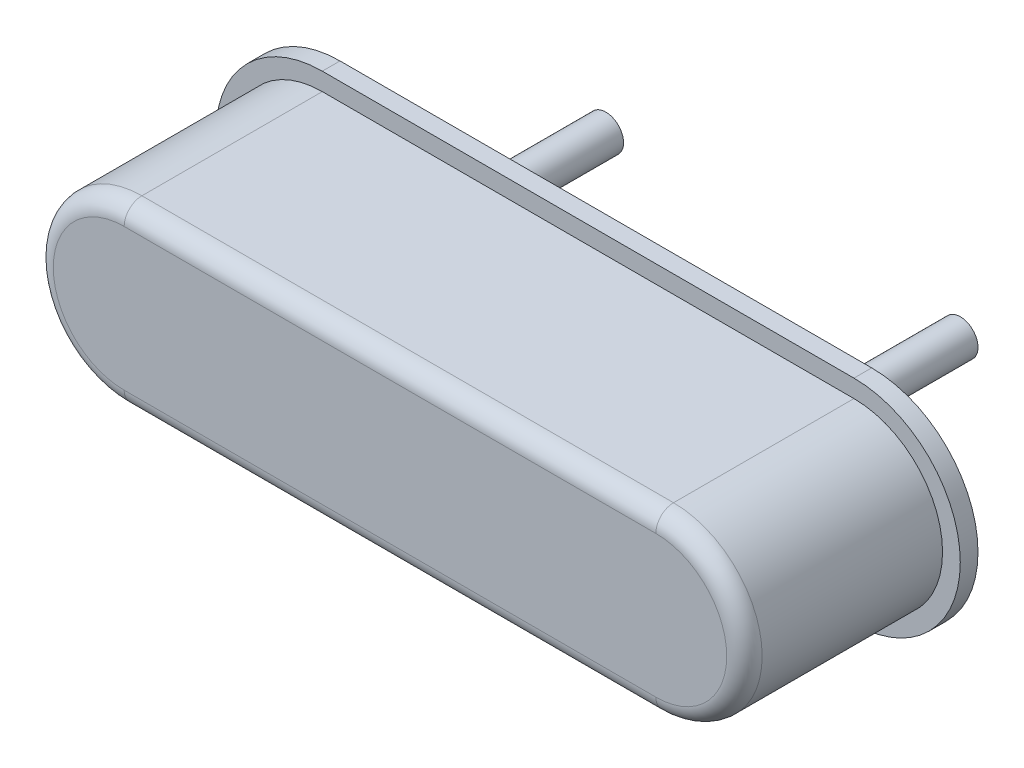
ISO-10303-21;
HEADER;
FILE_DESCRIPTION(('STEP AP214'),'2;1');
FILE_NAME('part.step','',(''),(''),'','','');
FILE_SCHEMA(('AUTOMOTIVE_DESIGN { 1 0 10303 214 1 1 1 1 }'));
ENDSEC;
DATA;
#1=APPLICATION_CONTEXT('core data for automotive mechanical design processes');
#2=APPLICATION_PROTOCOL_DEFINITION('international standard','automotive_design',2000,#1);
#3=PRODUCT_CONTEXT('',#1,'mechanical');
#4=PRODUCT('Part','Part','',(#3));
#5=PRODUCT_RELATED_PRODUCT_CATEGORY('part','',(#4));
#6=PRODUCT_DEFINITION_FORMATION('','',#4);
#7=PRODUCT_DEFINITION_CONTEXT('part definition',#1,'design');
#8=PRODUCT_DEFINITION('design','',#6,#7);
#9=PRODUCT_DEFINITION_SHAPE('','',#8);
#10=(LENGTH_UNIT() NAMED_UNIT(*) SI_UNIT(.MILLI.,.METRE.));
#11=(NAMED_UNIT(*) PLANE_ANGLE_UNIT() SI_UNIT($,.RADIAN.));
#12=(NAMED_UNIT(*) SI_UNIT($,.STERADIAN.) SOLID_ANGLE_UNIT());
#13=UNCERTAINTY_MEASURE_WITH_UNIT(LENGTH_MEASURE(1.E-05),#10,'distance_accuracy_value','');
#14=(GEOMETRIC_REPRESENTATION_CONTEXT(3) GLOBAL_UNCERTAINTY_ASSIGNED_CONTEXT((#13)) GLOBAL_UNIT_ASSIGNED_CONTEXT((#10,
#11,#12)) REPRESENTATION_CONTEXT('',''));
#15=CARTESIAN_POINT('',(0.,0.,0.));
#16=DIRECTION('',(0.,0.,1.));
#17=DIRECTION('',(1.,0.,0.));
#18=AXIS2_PLACEMENT_3D('',#15,#16,#17);
#19=CARTESIAN_POINT('',(7.62,1.27,3.09361477877701));
#20=DIRECTION('',(0.,0.,1.));
#21=DIRECTION('',(1.,0.,0.));
#22=AXIS2_PLACEMENT_3D('',#19,#20,#21);
#23=PLANE('',#22);
#24=CARTESIAN_POINT('',(-1.27,0.,3.09361477877701));
#25=DIRECTION('',(0.,0.,1.));
#26=DIRECTION('',(1.,0.,0.));
#27=AXIS2_PLACEMENT_3D('',#24,#25,#26);
#28=CIRCLE('',#27,1.016);
#29=CARTESIAN_POINT('',(-1.27,-1.016,3.09361477877701));
#30=VERTEX_POINT('',#29);
#31=CARTESIAN_POINT('',(-1.27,1.016,3.09361477877701));
#32=VERTEX_POINT('',#31);
#33=EDGE_CURVE('E132',#30,#32,#28,.F.);
#34=ORIENTED_EDGE('',*,*,#33,.F.);
#35=DIRECTION('',(1.,0.,0.));
#36=VECTOR('',#35,1.);
#37=CARTESIAN_POINT('',(-2.54,-1.016,3.09361477877701));
#38=LINE('',#37,#36);
#39=CARTESIAN_POINT('',(6.35,-1.016,3.09361477877701));
#40=VERTEX_POINT('',#39);
#41=EDGE_CURVE('E111',#40,#30,#38,.F.);
#42=ORIENTED_EDGE('',*,*,#41,.F.);
#43=CARTESIAN_POINT('',(6.35,0.,3.09361477877701));
#44=DIRECTION('',(0.,0.,1.));
#45=DIRECTION('',(1.,0.,0.));
#46=AXIS2_PLACEMENT_3D('',#43,#44,#45);
#47=CIRCLE('',#46,1.016);
#48=CARTESIAN_POINT('',(6.35,1.016,3.09361477877701));
#49=VERTEX_POINT('',#48);
#50=EDGE_CURVE('E106',#49,#40,#47,.F.);
#51=ORIENTED_EDGE('',*,*,#50,.F.);
#52=DIRECTION('',(-1.,0.,0.));
#53=VECTOR('',#52,1.);
#54=CARTESIAN_POINT('',(7.62,1.016,3.09361477877701));
#55=LINE('',#54,#53);
#56=EDGE_CURVE('E108',#32,#49,#55,.F.);
#57=ORIENTED_EDGE('',*,*,#56,.F.);
#58=EDGE_LOOP('',(#34,#42,#51,#57));
#59=FACE_BOUND('',#58,.T.);
#60=ADVANCED_FACE('F17',(#59),#23,.T.);
#61=CARTESIAN_POINT('',(-1.27,0.,2.83961477877701));
#62=DIRECTION('',(0.,0.,1.));
#63=DIRECTION('',(1.,0.,0.));
#64=AXIS2_PLACEMENT_3D('',#61,#62,#63);
#65=TOROIDAL_SURFACE('',#64,1.016,0.254);
#66=CARTESIAN_POINT('',(-1.27,-1.016,2.83961477877701));
#67=DIRECTION('',(1.,0.,0.));
#68=DIRECTION('',(0.,0.,-1.));
#69=AXIS2_PLACEMENT_3D('',#66,#67,#68);
#70=CIRCLE('',#69,0.254);
#71=CARTESIAN_POINT('',(-1.27,-1.27,2.83961477877701));
#72=VERTEX_POINT('',#71);
#73=EDGE_CURVE('E131',#30,#72,#70,.T.);
#74=ORIENTED_EDGE('',*,*,#73,.F.);
#75=ORIENTED_EDGE('',*,*,#33,.T.);
#76=CARTESIAN_POINT('',(-1.27,1.016,2.83961477877701));
#77=DIRECTION('',(-1.,0.,0.));
#78=DIRECTION('',(0.,0.,1.));
#79=AXIS2_PLACEMENT_3D('',#76,#77,#78);
#80=CIRCLE('',#79,0.254);
#81=CARTESIAN_POINT('',(-1.27,1.27,2.83961477877701));
#82=VERTEX_POINT('',#81);
#83=EDGE_CURVE('E113',#82,#32,#80,.F.);
#84=ORIENTED_EDGE('',*,*,#83,.F.);
#85=CARTESIAN_POINT('',(-1.27,0.,2.83961477877701));
#86=DIRECTION('',(0.,0.,-1.));
#87=DIRECTION('',(-1.,0.,0.));
#88=AXIS2_PLACEMENT_3D('',#85,#86,#87);
#89=CIRCLE('',#88,1.27);
#90=EDGE_CURVE('E120',#72,#82,#89,.T.);
#91=ORIENTED_EDGE('',*,*,#90,.F.);
#92=EDGE_LOOP('',(#74,#75,#84,#91));
#93=FACE_BOUND('',#92,.T.);
#94=ADVANCED_FACE('F215',(#93),#65,.T.);
#95=CARTESIAN_POINT('',(-2.54,-1.016,2.83961477877701));
#96=DIRECTION('',(1.,0.,0.));
#97=DIRECTION('',(0.,0.,-1.));
#98=AXIS2_PLACEMENT_3D('',#95,#96,#97);
#99=CYLINDRICAL_SURFACE('',#98,0.254);
#100=ORIENTED_EDGE('',*,*,#73,.T.);
#101=DIRECTION('',(1.,0.,0.));
#102=VECTOR('',#101,1.);
#103=CARTESIAN_POINT('',(-2.54,-1.27,2.83961477877701));
#104=LINE('',#103,#102);
#105=CARTESIAN_POINT('',(6.35,-1.27,2.83961477877701));
#106=VERTEX_POINT('',#105);
#107=EDGE_CURVE('E184',#72,#106,#104,.T.);
#108=ORIENTED_EDGE('',*,*,#107,.T.);
#109=CARTESIAN_POINT('',(6.35,-1.016,2.83961477877701));
#110=DIRECTION('',(1.,0.,0.));
#111=DIRECTION('',(0.,0.,1.));
#112=AXIS2_PLACEMENT_3D('',#109,#110,#111);
#113=CIRCLE('',#112,0.254);
#114=EDGE_CURVE('E114',#40,#106,#113,.T.);
#115=ORIENTED_EDGE('',*,*,#114,.F.);
#116=ORIENTED_EDGE('',*,*,#41,.T.);
#117=EDGE_LOOP('',(#100,#108,#115,#116));
#118=FACE_BOUND('',#117,.T.);
#119=ADVANCED_FACE('F395',(#118),#99,.T.);
#120=CARTESIAN_POINT('',(6.35,0.,2.83961477877701));
#121=DIRECTION('',(0.,0.,1.));
#122=DIRECTION('',(1.,0.,0.));
#123=AXIS2_PLACEMENT_3D('',#120,#121,#122);
#124=TOROIDAL_SURFACE('',#123,1.016,0.253999999999999);
#125=CARTESIAN_POINT('',(6.35,0.,2.83961477877701));
#126=DIRECTION('',(0.,0.,1.));
#127=DIRECTION('',(1.,0.,0.));
#128=AXIS2_PLACEMENT_3D('',#125,#126,#127);
#129=CIRCLE('',#128,1.27);
#130=CARTESIAN_POINT('',(6.35,1.27,2.83961477877701));
#131=VERTEX_POINT('',#130);
#132=EDGE_CURVE('E83',#131,#106,#129,.F.);
#133=ORIENTED_EDGE('',*,*,#132,.F.);
#134=CARTESIAN_POINT('',(6.35,1.016,2.83961477877701));
#135=DIRECTION('',(-1.,0.,0.));
#136=DIRECTION('',(0.,0.,1.));
#137=AXIS2_PLACEMENT_3D('',#134,#135,#136);
#138=CIRCLE('',#137,0.254);
#139=EDGE_CURVE('E116',#49,#131,#138,.T.);
#140=ORIENTED_EDGE('',*,*,#139,.F.);
#141=ORIENTED_EDGE('',*,*,#50,.T.);
#142=ORIENTED_EDGE('',*,*,#114,.T.);
#143=EDGE_LOOP('',(#133,#140,#141,#142));
#144=FACE_BOUND('',#143,.T.);
#145=ADVANCED_FACE('F19',(#144),#124,.T.);
#146=CARTESIAN_POINT('',(7.62,1.016,2.83961477877701));
#147=DIRECTION('',(-1.,0.,0.));
#148=DIRECTION('',(0.,0.,1.));
#149=AXIS2_PLACEMENT_3D('',#146,#147,#148);
#150=CYLINDRICAL_SURFACE('',#149,0.254);
#151=ORIENTED_EDGE('',*,*,#139,.T.);
#152=DIRECTION('',(1.,0.,0.));
#153=VECTOR('',#152,1.);
#154=CARTESIAN_POINT('',(-2.54,1.27,2.83961477877701));
#155=LINE('',#154,#153);
#156=EDGE_CURVE('E174',#82,#131,#155,.T.);
#157=ORIENTED_EDGE('',*,*,#156,.F.);
#158=ORIENTED_EDGE('',*,*,#83,.T.);
#159=ORIENTED_EDGE('',*,*,#56,.T.);
#160=EDGE_LOOP('',(#151,#157,#158,#159));
#161=FACE_BOUND('',#160,.T.);
#162=ADVANCED_FACE('F122',(#161),#150,.T.);
#163=CARTESIAN_POINT('',(-1.27,0.,0.));
#164=DIRECTION('',(0.,0.,-1.));
#165=DIRECTION('',(-1.,0.,0.));
#166=AXIS2_PLACEMENT_3D('',#163,#164,#165);
#167=CYLINDRICAL_SURFACE('',#166,1.27);
#168=CARTESIAN_POINT('',(-1.27,0.,0.254));
#169=DIRECTION('',(0.,0.,-1.));
#170=DIRECTION('',(-1.,0.,0.));
#171=AXIS2_PLACEMENT_3D('',#168,#169,#170);
#172=CIRCLE('',#171,1.27);
#173=CARTESIAN_POINT('',(-1.27,1.27,0.254));
#174=VERTEX_POINT('',#173);
#175=CARTESIAN_POINT('',(-1.27,-1.27,0.254));
#176=VERTEX_POINT('',#175);
#177=EDGE_CURVE('E21',#174,#176,#172,.F.);
#178=ORIENTED_EDGE('',*,*,#177,.T.);
#179=DIRECTION('',(0.,0.,1.));
#180=VECTOR('',#179,1.);
#181=CARTESIAN_POINT('',(-1.27,-1.27,0.));
#182=LINE('',#181,#180);
#183=EDGE_CURVE('E187',#176,#72,#182,.T.);
#184=ORIENTED_EDGE('',*,*,#183,.T.);
#185=ORIENTED_EDGE('',*,*,#90,.T.);
#186=DIRECTION('',(0.,0.,1.));
#187=VECTOR('',#186,1.);
#188=CARTESIAN_POINT('',(-1.27,1.27,0.));
#189=LINE('',#188,#187);
#190=EDGE_CURVE('E177',#174,#82,#189,.T.);
#191=ORIENTED_EDGE('',*,*,#190,.F.);
#192=EDGE_LOOP('',(#178,#184,#185,#191));
#193=FACE_BOUND('',#192,.T.);
#194=ADVANCED_FACE('F212',(#193),#167,.T.);
#195=CARTESIAN_POINT('',(-2.54,-1.27,0.));
#196=DIRECTION('',(0.,1.,0.));
#197=DIRECTION('',(0.,0.,1.));
#198=AXIS2_PLACEMENT_3D('',#195,#196,#197);
#199=PLANE('',#198);
#200=ORIENTED_EDGE('',*,*,#107,.F.);
#201=ORIENTED_EDGE('',*,*,#183,.F.);
#202=DIRECTION('',(-1.,0.,0.));
#203=VECTOR('',#202,1.);
#204=CARTESIAN_POINT('',(6.35,-1.27,0.254));
#205=LINE('',#204,#203);
#206=CARTESIAN_POINT('',(6.35,-1.27,0.254));
#207=VERTEX_POINT('',#206);
#208=EDGE_CURVE('E158',#176,#207,#205,.F.);
#209=ORIENTED_EDGE('',*,*,#208,.T.);
#210=DIRECTION('',(0.,0.,1.));
#211=VECTOR('',#210,1.);
#212=CARTESIAN_POINT('',(6.35,-1.27,0.));
#213=LINE('',#212,#211);
#214=EDGE_CURVE('E182',#106,#207,#213,.F.);
#215=ORIENTED_EDGE('',*,*,#214,.F.);
#216=EDGE_LOOP('',(#200,#201,#209,#215));
#217=FACE_BOUND('',#216,.T.);
#218=ADVANCED_FACE('F370',(#217),#199,.F.);
#219=CARTESIAN_POINT('',(6.35,0.,0.));
#220=DIRECTION('',(0.,0.,1.));
#221=DIRECTION('',(1.,0.,0.));
#222=AXIS2_PLACEMENT_3D('',#219,#220,#221);
#223=CYLINDRICAL_SURFACE('',#222,1.27);
#224=DIRECTION('',(0.,0.,1.));
#225=VECTOR('',#224,1.);
#226=CARTESIAN_POINT('',(6.35,1.27,0.));
#227=LINE('',#226,#225);
#228=CARTESIAN_POINT('',(6.35,1.27,0.254));
#229=VERTEX_POINT('',#228);
#230=EDGE_CURVE('E168',#131,#229,#227,.F.);
#231=ORIENTED_EDGE('',*,*,#230,.F.);
#232=ORIENTED_EDGE('',*,*,#132,.T.);
#233=ORIENTED_EDGE('',*,*,#214,.T.);
#234=CARTESIAN_POINT('',(6.35,0.,0.254));
#235=DIRECTION('',(0.,0.,1.));
#236=DIRECTION('',(1.,0.,0.));
#237=AXIS2_PLACEMENT_3D('',#234,#235,#236);
#238=CIRCLE('',#237,1.27);
#239=EDGE_CURVE('E157',#207,#229,#238,.T.);
#240=ORIENTED_EDGE('',*,*,#239,.T.);
#241=EDGE_LOOP('',(#231,#232,#233,#240));
#242=FACE_BOUND('',#241,.T.);
#243=ADVANCED_FACE('F363',(#242),#223,.T.);
#244=CARTESIAN_POINT('',(-2.54,1.27,0.));
#245=DIRECTION('',(0.,1.,0.));
#246=DIRECTION('',(0.,0.,1.));
#247=AXIS2_PLACEMENT_3D('',#244,#245,#246);
#248=PLANE('',#247);
#249=ORIENTED_EDGE('',*,*,#230,.T.);
#250=DIRECTION('',(-1.,0.,0.));
#251=VECTOR('',#250,1.);
#252=CARTESIAN_POINT('',(6.35,1.27,0.254));
#253=LINE('',#252,#251);
#254=EDGE_CURVE('E156',#229,#174,#253,.T.);
#255=ORIENTED_EDGE('',*,*,#254,.T.);
#256=ORIENTED_EDGE('',*,*,#190,.T.);
#257=ORIENTED_EDGE('',*,*,#156,.T.);
#258=EDGE_LOOP('',(#249,#255,#256,#257));
#259=FACE_BOUND('',#258,.T.);
#260=ADVANCED_FACE('F217',(#259),#248,.T.);
#261=CARTESIAN_POINT('',(6.35,0.,0.254));
#262=DIRECTION('',(0.,0.,-1.));
#263=DIRECTION('',(-1.,0.,0.));
#264=AXIS2_PLACEMENT_3D('',#261,#262,#263);
#265=PLANE('',#264);
#266=ORIENTED_EDGE('',*,*,#239,.F.);
#267=ORIENTED_EDGE('',*,*,#208,.F.);
#268=ORIENTED_EDGE('',*,*,#177,.F.);
#269=ORIENTED_EDGE('',*,*,#254,.F.);
#270=EDGE_LOOP('',(#266,#267,#268,#269));
#271=FACE_BOUND('',#270,.T.);
#272=CARTESIAN_POINT('',(-1.27,0.,0.254));
#273=DIRECTION('',(0.,0.,-1.));
#274=DIRECTION('',(-1.,0.,0.));
#275=AXIS2_PLACEMENT_3D('',#272,#273,#274);
#276=CIRCLE('',#275,1.524);
#277=CARTESIAN_POINT('',(-1.27,-1.524,0.254));
#278=VERTEX_POINT('',#277);
#279=CARTESIAN_POINT('',(-1.27,1.524,0.254));
#280=VERTEX_POINT('',#279);
#281=EDGE_CURVE('E153',#278,#280,#276,.T.);
#282=ORIENTED_EDGE('',*,*,#281,.F.);
#283=DIRECTION('',(1.,0.,0.));
#284=VECTOR('',#283,1.);
#285=CARTESIAN_POINT('',(6.35,-1.524,0.254));
#286=LINE('',#285,#284);
#287=CARTESIAN_POINT('',(6.35,-1.524,0.254));
#288=VERTEX_POINT('',#287);
#289=EDGE_CURVE('E225',#288,#278,#286,.F.);
#290=ORIENTED_EDGE('',*,*,#289,.F.);
#291=CARTESIAN_POINT('',(6.35,0.,0.254));
#292=DIRECTION('',(0.,0.,-1.));
#293=DIRECTION('',(-1.,0.,0.));
#294=AXIS2_PLACEMENT_3D('',#291,#292,#293);
#295=CIRCLE('',#294,1.524);
#296=CARTESIAN_POINT('',(6.35,1.524,0.254));
#297=VERTEX_POINT('',#296);
#298=EDGE_CURVE('E149',#297,#288,#295,.T.);
#299=ORIENTED_EDGE('',*,*,#298,.F.);
#300=DIRECTION('',(1.,0.,0.));
#301=VECTOR('',#300,1.);
#302=CARTESIAN_POINT('',(-1.27,1.524,0.254));
#303=LINE('',#302,#301);
#304=EDGE_CURVE('E155',#280,#297,#303,.T.);
#305=ORIENTED_EDGE('',*,*,#304,.F.);
#306=EDGE_LOOP('',(#282,#290,#299,#305));
#307=FACE_BOUND('',#306,.T.);
#308=ADVANCED_FACE('F218',(#271,#307),#265,.F.);
#309=CARTESIAN_POINT('',(5.08,0.,-2.54));
#310=DIRECTION('',(0.,0.,1.));
#311=DIRECTION('',(1.,0.,0.));
#312=AXIS2_PLACEMENT_3D('',#309,#310,#311);
#313=PLANE('',#312);
#314=CARTESIAN_POINT('',(5.08,0.,-2.54));
#315=DIRECTION('',(0.,0.,-1.));
#316=DIRECTION('',(-1.,0.,0.));
#317=AXIS2_PLACEMENT_3D('',#314,#315,#316);
#318=CIRCLE('',#317,0.254);
#319=CARTESIAN_POINT('',(4.826,0.,-2.54));
#320=VERTEX_POINT('',#319);
#321=EDGE_CURVE('E146',#320,#320,#318,.F.);
#322=ORIENTED_EDGE('',*,*,#321,.F.);
#323=EDGE_LOOP('',(#322));
#324=FACE_BOUND('',#323,.T.);
#325=ADVANCED_FACE('F221',(#324),#313,.F.);
#326=CARTESIAN_POINT('',(0.,0.,-2.54));
#327=DIRECTION('',(0.,0.,1.));
#328=DIRECTION('',(1.,0.,0.));
#329=AXIS2_PLACEMENT_3D('',#326,#327,#328);
#330=PLANE('',#329);
#331=CARTESIAN_POINT('',(0.,0.,-2.54));
#332=DIRECTION('',(0.,0.,-1.));
#333=DIRECTION('',(-1.,0.,0.));
#334=AXIS2_PLACEMENT_3D('',#331,#332,#333);
#335=CIRCLE('',#334,0.254);
#336=CARTESIAN_POINT('',(-0.254,0.,-2.54));
#337=VERTEX_POINT('',#336);
#338=EDGE_CURVE('E143',#337,#337,#335,.F.);
#339=ORIENTED_EDGE('',*,*,#338,.F.);
#340=EDGE_LOOP('',(#339));
#341=FACE_BOUND('',#340,.T.);
#342=ADVANCED_FACE('F257',(#341),#330,.F.);
#343=CARTESIAN_POINT('',(-1.27,0.,0.254));
#344=DIRECTION('',(0.,0.,-1.));
#345=DIRECTION('',(-1.,0.,0.));
#346=AXIS2_PLACEMENT_3D('',#343,#344,#345);
#347=CYLINDRICAL_SURFACE('',#346,1.524);
#348=DIRECTION('',(0.,0.,1.));
#349=VECTOR('',#348,1.);
#350=CARTESIAN_POINT('',(-1.27,1.524,0.254));
#351=LINE('',#350,#349);
#352=CARTESIAN_POINT('',(-1.27,1.524,0.));
#353=VERTEX_POINT('',#352);
#354=EDGE_CURVE('E152',#353,#280,#351,.T.);
#355=ORIENTED_EDGE('',*,*,#354,.F.);
#356=CARTESIAN_POINT('',(-1.27,0.,0.));
#357=DIRECTION('',(0.,0.,-1.));
#358=DIRECTION('',(-1.,0.,0.));
#359=AXIS2_PLACEMENT_3D('',#356,#357,#358);
#360=CIRCLE('',#359,1.524);
#361=CARTESIAN_POINT('',(-1.27,-1.524,0.));
#362=VERTEX_POINT('',#361);
#363=EDGE_CURVE('E141',#362,#353,#360,.T.);
#364=ORIENTED_EDGE('',*,*,#363,.F.);
#365=DIRECTION('',(0.,0.,-1.));
#366=VECTOR('',#365,1.);
#367=CARTESIAN_POINT('',(-1.27,-1.524,0.254));
#368=LINE('',#367,#366);
#369=EDGE_CURVE('E230',#278,#362,#368,.T.);
#370=ORIENTED_EDGE('',*,*,#369,.F.);
#371=ORIENTED_EDGE('',*,*,#281,.T.);
#372=EDGE_LOOP('',(#355,#364,#370,#371));
#373=FACE_BOUND('',#372,.T.);
#374=ADVANCED_FACE('F231',(#373),#347,.T.);
#375=CARTESIAN_POINT('',(-1.27,1.524,0.254));
#376=DIRECTION('',(0.,1.,0.));
#377=DIRECTION('',(0.,0.,1.));
#378=AXIS2_PLACEMENT_3D('',#375,#376,#377);
#379=PLANE('',#378);
#380=DIRECTION('',(-1.,0.,0.));
#381=VECTOR('',#380,1.);
#382=CARTESIAN_POINT('',(-2.54,1.524,0.));
#383=LINE('',#382,#381);
#384=CARTESIAN_POINT('',(6.35,1.524,0.));
#385=VERTEX_POINT('',#384);
#386=EDGE_CURVE('E140',#353,#385,#383,.F.);
#387=ORIENTED_EDGE('',*,*,#386,.F.);
#388=ORIENTED_EDGE('',*,*,#354,.T.);
#389=ORIENTED_EDGE('',*,*,#304,.T.);
#390=DIRECTION('',(0.,0.,-1.));
#391=VECTOR('',#390,1.);
#392=CARTESIAN_POINT('',(6.35,1.524,0.254));
#393=LINE('',#392,#391);
#394=EDGE_CURVE('E151',#385,#297,#393,.F.);
#395=ORIENTED_EDGE('',*,*,#394,.F.);
#396=EDGE_LOOP('',(#387,#388,#389,#395));
#397=FACE_BOUND('',#396,.T.);
#398=ADVANCED_FACE('F248',(#397),#379,.T.);
#399=CARTESIAN_POINT('',(6.35,0.,0.254));
#400=DIRECTION('',(0.,0.,-1.));
#401=DIRECTION('',(-1.,0.,0.));
#402=AXIS2_PLACEMENT_3D('',#399,#400,#401);
#403=CYLINDRICAL_SURFACE('',#402,1.524);
#404=CARTESIAN_POINT('',(6.35,0.,0.));
#405=DIRECTION('',(0.,0.,-1.));
#406=DIRECTION('',(-1.,0.,0.));
#407=AXIS2_PLACEMENT_3D('',#404,#405,#406);
#408=CIRCLE('',#407,1.524);
#409=CARTESIAN_POINT('',(6.35,-1.524,0.));
#410=VERTEX_POINT('',#409);
#411=EDGE_CURVE('E137',#385,#410,#408,.T.);
#412=ORIENTED_EDGE('',*,*,#411,.F.);
#413=ORIENTED_EDGE('',*,*,#394,.T.);
#414=ORIENTED_EDGE('',*,*,#298,.T.);
#415=DIRECTION('',(0.,0.,-1.));
#416=VECTOR('',#415,1.);
#417=CARTESIAN_POINT('',(6.35,-1.524,0.254));
#418=LINE('',#417,#416);
#419=EDGE_CURVE('E36',#410,#288,#418,.F.);
#420=ORIENTED_EDGE('',*,*,#419,.F.);
#421=EDGE_LOOP('',(#412,#413,#414,#420));
#422=FACE_BOUND('',#421,.T.);
#423=ADVANCED_FACE('F246',(#422),#403,.T.);
#424=CARTESIAN_POINT('',(6.35,-1.524,0.254));
#425=DIRECTION('',(0.,-1.,0.));
#426=DIRECTION('',(0.,0.,-1.));
#427=AXIS2_PLACEMENT_3D('',#424,#425,#426);
#428=PLANE('',#427);
#429=DIRECTION('',(-1.,0.,0.));
#430=VECTOR('',#429,1.);
#431=CARTESIAN_POINT('',(-2.54,-1.524,0.));
#432=LINE('',#431,#430);
#433=EDGE_CURVE('E136',#410,#362,#432,.T.);
#434=ORIENTED_EDGE('',*,*,#433,.F.);
#435=ORIENTED_EDGE('',*,*,#419,.T.);
#436=ORIENTED_EDGE('',*,*,#289,.T.);
#437=ORIENTED_EDGE('',*,*,#369,.T.);
#438=EDGE_LOOP('',(#434,#435,#436,#437));
#439=FACE_BOUND('',#438,.T.);
#440=ADVANCED_FACE('F235',(#439),#428,.T.);
#441=CARTESIAN_POINT('',(5.08,0.,0.508));
#442=DIRECTION('',(0.,0.,-1.));
#443=DIRECTION('',(-1.,0.,0.));
#444=AXIS2_PLACEMENT_3D('',#441,#442,#443);
#445=CYLINDRICAL_SURFACE('',#444,0.254);
#446=ORIENTED_EDGE('',*,*,#321,.T.);
#447=EDGE_LOOP('',(#446));
#448=FACE_BOUND('',#447,.T.);
#449=CARTESIAN_POINT('',(5.08,0.,0.));
#450=DIRECTION('',(0.,0.,-1.));
#451=DIRECTION('',(-1.,0.,0.));
#452=AXIS2_PLACEMENT_3D('',#449,#450,#451);
#453=CIRCLE('',#452,0.254);
#454=CARTESIAN_POINT('',(4.826,0.,0.));
#455=VERTEX_POINT('',#454);
#456=EDGE_CURVE('E27',#455,#455,#453,.F.);
#457=ORIENTED_EDGE('',*,*,#456,.F.);
#458=EDGE_LOOP('',(#457));
#459=FACE_BOUND('',#458,.T.);
#460=ADVANCED_FACE('F266',(#448,#459),#445,.T.);
#461=CARTESIAN_POINT('',(0.,0.,0.508));
#462=DIRECTION('',(0.,0.,-1.));
#463=DIRECTION('',(-1.,0.,0.));
#464=AXIS2_PLACEMENT_3D('',#461,#462,#463);
#465=CYLINDRICAL_SURFACE('',#464,0.254);
#466=ORIENTED_EDGE('',*,*,#338,.T.);
#467=EDGE_LOOP('',(#466));
#468=FACE_BOUND('',#467,.T.);
#469=CARTESIAN_POINT('',(0.,0.,0.));
#470=DIRECTION('',(0.,0.,-1.));
#471=DIRECTION('',(-1.,0.,0.));
#472=AXIS2_PLACEMENT_3D('',#469,#470,#471);
#473=CIRCLE('',#472,0.254);
#474=CARTESIAN_POINT('',(-0.254,0.,0.));
#475=VERTEX_POINT('',#474);
#476=EDGE_CURVE('E11',#475,#475,#473,.F.);
#477=ORIENTED_EDGE('',*,*,#476,.F.);
#478=EDGE_LOOP('',(#477));
#479=FACE_BOUND('',#478,.T.);
#480=ADVANCED_FACE('F260',(#468,#479),#465,.T.);
#481=CARTESIAN_POINT('',(-2.54,1.27,0.));
#482=DIRECTION('',(0.,0.,-1.));
#483=DIRECTION('',(-1.,0.,0.));
#484=AXIS2_PLACEMENT_3D('',#481,#482,#483);
#485=PLANE('',#484);
#486=ORIENTED_EDGE('',*,*,#476,.T.);
#487=EDGE_LOOP('',(#486));
#488=FACE_BOUND('',#487,.T.);
#489=ORIENTED_EDGE('',*,*,#456,.T.);
#490=EDGE_LOOP('',(#489));
#491=FACE_BOUND('',#490,.T.);
#492=ORIENTED_EDGE('',*,*,#411,.T.);
#493=ORIENTED_EDGE('',*,*,#433,.T.);
#494=ORIENTED_EDGE('',*,*,#363,.T.);
#495=ORIENTED_EDGE('',*,*,#386,.T.);
#496=EDGE_LOOP('',(#492,#493,#494,#495));
#497=FACE_BOUND('',#496,.T.);
#498=ADVANCED_FACE('F244',(#488,#491,#497),#485,.T.);
#499=CLOSED_SHELL('',(#60,#94,#119,#145,#162,#194,#218,#243,#260,#308,#325,#342,#374,#398,#423,
#440,#460,#480,#498));
#500=MANIFOLD_SOLID_BREP('B1',#499);
#501=ADVANCED_BREP_SHAPE_REPRESENTATION('',(#18,#500),#14);
#502=SHAPE_DEFINITION_REPRESENTATION(#9,#501);
ENDSEC;
END-ISO-10303-21;
